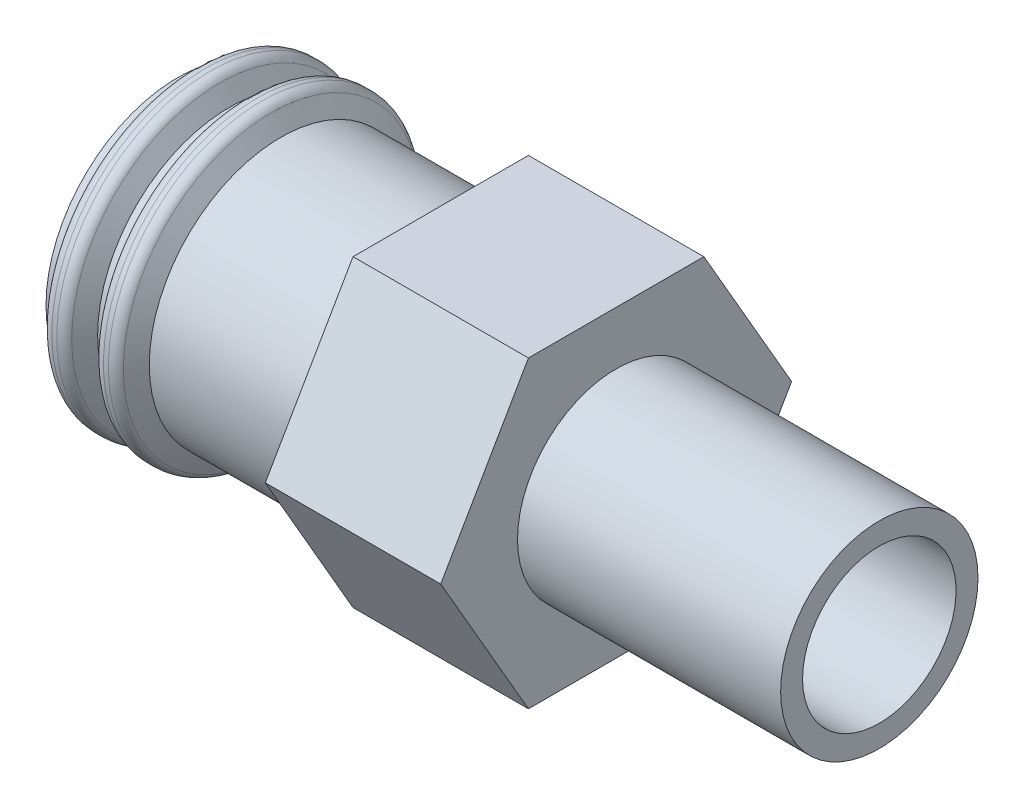
ISO-10303-21;
HEADER;
FILE_DESCRIPTION(('STEP AP214'),'2;1');
FILE_NAME('part.step','',(''),(''),'','','');
FILE_SCHEMA(('AUTOMOTIVE_DESIGN { 1 0 10303 214 1 1 1 1 }'));
ENDSEC;
DATA;
#1=APPLICATION_CONTEXT('core data for automotive mechanical design processes');
#2=APPLICATION_PROTOCOL_DEFINITION('international standard','automotive_design',2000,#1);
#3=PRODUCT_CONTEXT('',#1,'mechanical');
#4=PRODUCT('Part','Part','',(#3));
#5=PRODUCT_RELATED_PRODUCT_CATEGORY('part','',(#4));
#6=PRODUCT_DEFINITION_FORMATION('','',#4);
#7=PRODUCT_DEFINITION_CONTEXT('part definition',#1,'design');
#8=PRODUCT_DEFINITION('design','',#6,#7);
#9=PRODUCT_DEFINITION_SHAPE('','',#8);
#10=(LENGTH_UNIT() NAMED_UNIT(*) SI_UNIT(.MILLI.,.METRE.));
#11=(NAMED_UNIT(*) PLANE_ANGLE_UNIT() SI_UNIT($,.RADIAN.));
#12=(NAMED_UNIT(*) SI_UNIT($,.STERADIAN.) SOLID_ANGLE_UNIT());
#13=UNCERTAINTY_MEASURE_WITH_UNIT(LENGTH_MEASURE(1.E-05),#10,'distance_accuracy_value','');
#14=(GEOMETRIC_REPRESENTATION_CONTEXT(3) GLOBAL_UNCERTAINTY_ASSIGNED_CONTEXT((#13)) GLOBAL_UNIT_ASSIGNED_CONTEXT((#10,
#11,#12)) REPRESENTATION_CONTEXT('',''));
#15=CARTESIAN_POINT('',(0.,0.,0.));
#16=DIRECTION('',(0.,0.,1.));
#17=DIRECTION('',(1.,0.,0.));
#18=AXIS2_PLACEMENT_3D('',#15,#16,#17);
#19=CARTESIAN_POINT('',(1.5,4.,0.));
#20=DIRECTION('',(-1.,0.,0.));
#21=DIRECTION('',(0.,0.,1.));
#22=AXIS2_PLACEMENT_3D('',#19,#20,#21);
#23=PLANE('',#22);
#24=CARTESIAN_POINT('',(1.5,0.,0.));
#25=DIRECTION('',(-1.,0.,0.));
#26=DIRECTION('',(0.,0.,1.));
#27=AXIS2_PLACEMENT_3D('',#24,#25,#26);
#28=CIRCLE('',#27,2.25);
#29=CARTESIAN_POINT('',(1.5,0.,2.25));
#30=VERTEX_POINT('',#29);
#31=EDGE_CURVE('E168',#30,#30,#28,.T.);
#32=ORIENTED_EDGE('',*,*,#31,.T.);
#33=EDGE_LOOP('',(#32));
#34=FACE_BOUND('',#33,.T.);
#35=DIRECTION('',(0.,0.866025403784438,0.500000000000001));
#36=VECTOR('',#35,1.);
#37=CARTESIAN_POINT('',(1.5,1.73205080756888,-3.));
#38=LINE('',#37,#36);
#39=CARTESIAN_POINT('',(1.5,0.,-4.));
#40=VERTEX_POINT('',#39);
#41=CARTESIAN_POINT('',(1.5,3.46410161513776,-1.99999999999999));
#42=VERTEX_POINT('',#41);
#43=EDGE_CURVE('E104',#40,#42,#38,.T.);
#44=ORIENTED_EDGE('',*,*,#43,.T.);
#45=DIRECTION('',(0.,0.,1.));
#46=VECTOR('',#45,1.);
#47=CARTESIAN_POINT('',(1.5,3.46410161513775,0.));
#48=LINE('',#47,#46);
#49=CARTESIAN_POINT('',(1.5,3.46410161513775,2.00000000000002));
#50=VERTEX_POINT('',#49);
#51=EDGE_CURVE('E145',#42,#50,#48,.T.);
#52=ORIENTED_EDGE('',*,*,#51,.T.);
#53=DIRECTION('',(0.,-0.866025403784442,0.499999999999995));
#54=VECTOR('',#53,1.);
#55=CARTESIAN_POINT('',(1.5,1.73205080756886,3.00000000000001));
#56=LINE('',#55,#54);
#57=CARTESIAN_POINT('',(1.5,0.,4.));
#58=VERTEX_POINT('',#57);
#59=EDGE_CURVE('E60',#50,#58,#56,.T.);
#60=ORIENTED_EDGE('',*,*,#59,.T.);
#61=DIRECTION('',(0.,-0.866025403784435,-0.500000000000007));
#62=VECTOR('',#61,1.);
#63=CARTESIAN_POINT('',(1.5,-1.7320508075689,2.99999999999998));
#64=LINE('',#63,#62);
#65=CARTESIAN_POINT('',(1.5,-3.46410161513777,1.99999999999997));
#66=VERTEX_POINT('',#65);
#67=EDGE_CURVE('E69',#58,#66,#64,.T.);
#68=ORIENTED_EDGE('',*,*,#67,.T.);
#69=DIRECTION('',(0.,0.,-1.));
#70=VECTOR('',#69,1.);
#71=CARTESIAN_POINT('',(1.5,-3.46410161513775,0.));
#72=LINE('',#71,#70);
#73=CARTESIAN_POINT('',(1.5,-3.46410161513773,-2.00000000000004));
#74=VERTEX_POINT('',#73);
#75=EDGE_CURVE('E124',#66,#74,#72,.T.);
#76=ORIENTED_EDGE('',*,*,#75,.T.);
#77=DIRECTION('',(0.,0.866025403784442,-0.499999999999995));
#78=VECTOR('',#77,1.);
#79=CARTESIAN_POINT('',(1.5,-1.73205080756887,-3.00000000000002));
#80=LINE('',#79,#78);
#81=EDGE_CURVE('E109',#74,#40,#80,.T.);
#82=ORIENTED_EDGE('',*,*,#81,.T.);
#83=EDGE_LOOP('',(#44,#52,#60,#68,#76,#82));
#84=FACE_BOUND('',#83,.T.);
#85=ADVANCED_FACE('F45',(#34,#84),#23,.F.);
#86=CARTESIAN_POINT('',(-2.5,3.,0.));
#87=DIRECTION('',(1.,0.,0.));
#88=DIRECTION('',(0.,0.,-1.));
#89=AXIS2_PLACEMENT_3D('',#86,#87,#88);
#90=PLANE('',#89);
#91=CARTESIAN_POINT('',(-2.5,0.,0.));
#92=DIRECTION('',(-1.,0.,0.));
#93=DIRECTION('',(0.,0.,1.));
#94=AXIS2_PLACEMENT_3D('',#91,#92,#93);
#95=CIRCLE('',#94,3.);
#96=CARTESIAN_POINT('',(-2.5,0.,3.));
#97=VERTEX_POINT('',#96);
#98=EDGE_CURVE('E165',#97,#97,#95,.T.);
#99=ORIENTED_EDGE('',*,*,#98,.F.);
#100=EDGE_LOOP('',(#99));
#101=FACE_BOUND('',#100,.T.);
#102=DIRECTION('',(0.,0.866025403784438,0.500000000000001));
#103=VECTOR('',#102,1.);
#104=CARTESIAN_POINT('',(-2.5,1.73205080756888,-3.));
#105=LINE('',#104,#103);
#106=CARTESIAN_POINT('',(-2.5,0.,-4.));
#107=VERTEX_POINT('',#106);
#108=CARTESIAN_POINT('',(-2.5,3.46410161513776,-1.99999999999999));
#109=VERTEX_POINT('',#108);
#110=EDGE_CURVE('E101',#107,#109,#105,.T.);
#111=ORIENTED_EDGE('',*,*,#110,.F.);
#112=DIRECTION('',(0.,0.866025403784442,-0.499999999999995));
#113=VECTOR('',#112,1.);
#114=CARTESIAN_POINT('',(-2.5,-1.73205080756887,-3.00000000000002));
#115=LINE('',#114,#113);
#116=CARTESIAN_POINT('',(-2.5,-3.46410161513773,-2.00000000000004));
#117=VERTEX_POINT('',#116);
#118=EDGE_CURVE('E108',#117,#107,#115,.T.);
#119=ORIENTED_EDGE('',*,*,#118,.F.);
#120=DIRECTION('',(0.,0.,-1.));
#121=VECTOR('',#120,1.);
#122=CARTESIAN_POINT('',(-2.5,-3.46410161513775,0.));
#123=LINE('',#122,#121);
#124=CARTESIAN_POINT('',(-2.5,-3.46410161513777,1.99999999999997));
#125=VERTEX_POINT('',#124);
#126=EDGE_CURVE('E130',#125,#117,#123,.T.);
#127=ORIENTED_EDGE('',*,*,#126,.F.);
#128=DIRECTION('',(0.,-0.866025403784435,-0.500000000000007));
#129=VECTOR('',#128,1.);
#130=CARTESIAN_POINT('',(-2.5,-1.7320508075689,2.99999999999998));
#131=LINE('',#130,#129);
#132=CARTESIAN_POINT('',(-2.5,0.,4.));
#133=VERTEX_POINT('',#132);
#134=EDGE_CURVE('E135',#133,#125,#131,.T.);
#135=ORIENTED_EDGE('',*,*,#134,.F.);
#136=DIRECTION('',(0.,-0.866025403784442,0.499999999999995));
#137=VECTOR('',#136,1.);
#138=CARTESIAN_POINT('',(-2.5,1.73205080756886,3.00000000000001));
#139=LINE('',#138,#137);
#140=CARTESIAN_POINT('',(-2.5,3.46410161513775,2.00000000000002));
#141=VERTEX_POINT('',#140);
#142=EDGE_CURVE('E141',#141,#133,#139,.T.);
#143=ORIENTED_EDGE('',*,*,#142,.F.);
#144=DIRECTION('',(0.,0.,1.));
#145=VECTOR('',#144,1.);
#146=CARTESIAN_POINT('',(-2.5,3.46410161513775,0.));
#147=LINE('',#146,#145);
#148=EDGE_CURVE('E119',#109,#141,#147,.T.);
#149=ORIENTED_EDGE('',*,*,#148,.F.);
#150=EDGE_LOOP('',(#111,#119,#127,#135,#143,#149));
#151=FACE_BOUND('',#150,.T.);
#152=ADVANCED_FACE('F114',(#101,#151),#90,.F.);
#153=CARTESIAN_POINT('',(-29.7219053344211,0.,0.));
#154=DIRECTION('',(-1.,0.,0.));
#155=DIRECTION('',(0.,0.,1.));
#156=AXIS2_PLACEMENT_3D('',#153,#154,#155);
#157=CYLINDRICAL_SURFACE('',#156,3.);
#158=CARTESIAN_POINT('',(-8.5,0.,0.));
#159=DIRECTION('',(-1.,0.,0.));
#160=DIRECTION('',(0.,0.,1.));
#161=AXIS2_PLACEMENT_3D('',#158,#159,#160);
#162=CIRCLE('',#161,3.);
#163=CARTESIAN_POINT('',(-8.5,0.,3.));
#164=VERTEX_POINT('',#163);
#165=EDGE_CURVE('E186',#164,#164,#162,.T.);
#166=ORIENTED_EDGE('',*,*,#165,.F.);
#167=EDGE_LOOP('',(#166));
#168=FACE_BOUND('',#167,.T.);
#169=CARTESIAN_POINT('',(-8.3,0.,0.));
#170=DIRECTION('',(-1.,0.,0.));
#171=DIRECTION('',(0.,0.,1.));
#172=AXIS2_PLACEMENT_3D('',#169,#170,#171);
#173=CIRCLE('',#172,3.);
#174=CARTESIAN_POINT('',(-8.3,0.,3.));
#175=VERTEX_POINT('',#174);
#176=EDGE_CURVE('E152',#175,#175,#173,.T.);
#177=ORIENTED_EDGE('',*,*,#176,.T.);
#178=EDGE_LOOP('',(#177));
#179=FACE_BOUND('',#178,.T.);
#180=ADVANCED_FACE('F242',(#168,#179),#157,.T.);
#181=CARTESIAN_POINT('',(-8.5,2.5,0.));
#182=DIRECTION('',(1.,0.,0.));
#183=DIRECTION('',(0.,0.,-1.));
#184=AXIS2_PLACEMENT_3D('',#181,#182,#183);
#185=PLANE('',#184);
#186=CARTESIAN_POINT('',(-8.5,0.,0.));
#187=DIRECTION('',(-1.,0.,0.));
#188=DIRECTION('',(0.,0.,1.));
#189=AXIS2_PLACEMENT_3D('',#186,#187,#188);
#190=CIRCLE('',#189,2.5);
#191=CARTESIAN_POINT('',(-8.5,0.,2.5));
#192=VERTEX_POINT('',#191);
#193=EDGE_CURVE('E183',#192,#192,#190,.T.);
#194=ORIENTED_EDGE('',*,*,#193,.F.);
#195=EDGE_LOOP('',(#194));
#196=FACE_BOUND('',#195,.T.);
#197=ORIENTED_EDGE('',*,*,#165,.T.);
#198=EDGE_LOOP('',(#197));
#199=FACE_BOUND('',#198,.T.);
#200=ADVANCED_FACE('F268',(#196,#199),#185,.F.);
#201=CARTESIAN_POINT('',(-29.7219053344211,0.,0.));
#202=DIRECTION('',(-1.,0.,0.));
#203=DIRECTION('',(0.,0.,1.));
#204=AXIS2_PLACEMENT_3D('',#201,#202,#203);
#205=CYLINDRICAL_SURFACE('',#204,2.5);
#206=CARTESIAN_POINT('',(-4.5,0.,0.));
#207=DIRECTION('',(-1.,0.,0.));
#208=DIRECTION('',(0.,0.,1.));
#209=AXIS2_PLACEMENT_3D('',#206,#207,#208);
#210=CIRCLE('',#209,2.5);
#211=CARTESIAN_POINT('',(-4.5,0.,2.5));
#212=VERTEX_POINT('',#211);
#213=EDGE_CURVE('E180',#212,#212,#210,.T.);
#214=ORIENTED_EDGE('',*,*,#213,.F.);
#215=EDGE_LOOP('',(#214));
#216=FACE_BOUND('',#215,.T.);
#217=ORIENTED_EDGE('',*,*,#193,.T.);
#218=EDGE_LOOP('',(#217));
#219=FACE_BOUND('',#218,.T.);
#220=ADVANCED_FACE('F264',(#216,#219),#205,.F.);
#221=CARTESIAN_POINT('',(-4.5,0.,0.));
#222=DIRECTION('',(-1.,0.,0.));
#223=DIRECTION('',(0.,0.,1.));
#224=AXIS2_PLACEMENT_3D('',#221,#222,#223);
#225=CONICAL_SURFACE('',#224,2.5,0.523598775598292);
#226=CARTESIAN_POINT('',(-3.20096189432332,0.,0.));
#227=DIRECTION('',(-1.,0.,0.));
#228=DIRECTION('',(0.,0.,1.));
#229=AXIS2_PLACEMENT_3D('',#226,#227,#228);
#230=CIRCLE('',#229,1.75);
#231=CARTESIAN_POINT('',(-3.20096189432332,0.,1.75));
#232=VERTEX_POINT('',#231);
#233=EDGE_CURVE('E177',#232,#232,#230,.T.);
#234=ORIENTED_EDGE('',*,*,#233,.F.);
#235=EDGE_LOOP('',(#234));
#236=FACE_BOUND('',#235,.T.);
#237=ORIENTED_EDGE('',*,*,#213,.T.);
#238=EDGE_LOOP('',(#237));
#239=FACE_BOUND('',#238,.T.);
#240=ADVANCED_FACE('F260',(#236,#239),#225,.F.);
#241=CARTESIAN_POINT('',(-29.7219053344211,0.,0.));
#242=DIRECTION('',(-1.,0.,0.));
#243=DIRECTION('',(0.,0.,1.));
#244=AXIS2_PLACEMENT_3D('',#241,#242,#243);
#245=CYLINDRICAL_SURFACE('',#244,1.75);
#246=CARTESIAN_POINT('',(7.5,0.,0.));
#247=DIRECTION('',(-1.,0.,0.));
#248=DIRECTION('',(0.,0.,1.));
#249=AXIS2_PLACEMENT_3D('',#246,#247,#248);
#250=CIRCLE('',#249,1.75);
#251=CARTESIAN_POINT('',(7.5,0.,1.75));
#252=VERTEX_POINT('',#251);
#253=EDGE_CURVE('E174',#252,#252,#250,.T.);
#254=ORIENTED_EDGE('',*,*,#253,.F.);
#255=EDGE_LOOP('',(#254));
#256=FACE_BOUND('',#255,.T.);
#257=ORIENTED_EDGE('',*,*,#233,.T.);
#258=EDGE_LOOP('',(#257));
#259=FACE_BOUND('',#258,.T.);
#260=ADVANCED_FACE('F256',(#256,#259),#245,.F.);
#261=CARTESIAN_POINT('',(7.5,2.25,0.));
#262=DIRECTION('',(-1.,0.,0.));
#263=DIRECTION('',(0.,0.,1.));
#264=AXIS2_PLACEMENT_3D('',#261,#262,#263);
#265=PLANE('',#264);
#266=CARTESIAN_POINT('',(7.5,0.,0.));
#267=DIRECTION('',(-1.,0.,0.));
#268=DIRECTION('',(0.,0.,1.));
#269=AXIS2_PLACEMENT_3D('',#266,#267,#268);
#270=CIRCLE('',#269,2.25);
#271=CARTESIAN_POINT('',(7.5,0.,2.25));
#272=VERTEX_POINT('',#271);
#273=EDGE_CURVE('E171',#272,#272,#270,.T.);
#274=ORIENTED_EDGE('',*,*,#273,.F.);
#275=EDGE_LOOP('',(#274));
#276=FACE_BOUND('',#275,.T.);
#277=ORIENTED_EDGE('',*,*,#253,.T.);
#278=EDGE_LOOP('',(#277));
#279=FACE_BOUND('',#278,.T.);
#280=ADVANCED_FACE('F252',(#276,#279),#265,.F.);
#281=CARTESIAN_POINT('',(-29.7219053344211,0.,0.));
#282=DIRECTION('',(-1.,0.,0.));
#283=DIRECTION('',(0.,0.,1.));
#284=AXIS2_PLACEMENT_3D('',#281,#282,#283);
#285=CYLINDRICAL_SURFACE('',#284,2.25);
#286=ORIENTED_EDGE('',*,*,#31,.F.);
#287=EDGE_LOOP('',(#286));
#288=FACE_BOUND('',#287,.T.);
#289=ORIENTED_EDGE('',*,*,#273,.T.);
#290=EDGE_LOOP('',(#289));
#291=FACE_BOUND('',#290,.T.);
#292=ADVANCED_FACE('F248',(#288,#291),#285,.T.);
#293=CARTESIAN_POINT('',(-29.7219053344211,0.,0.));
#294=DIRECTION('',(-1.,0.,0.));
#295=DIRECTION('',(0.,0.,1.));
#296=AXIS2_PLACEMENT_3D('',#293,#294,#295);
#297=CYLINDRICAL_SURFACE('',#296,3.);
#298=CARTESIAN_POINT('',(-6.14529946162075,0.,0.));
#299=DIRECTION('',(-1.,0.,0.));
#300=DIRECTION('',(0.,0.,1.));
#301=AXIS2_PLACEMENT_3D('',#298,#299,#300);
#302=CIRCLE('',#301,3.);
#303=CARTESIAN_POINT('',(-6.14529946162075,0.,3.));
#304=VERTEX_POINT('',#303);
#305=EDGE_CURVE('E162',#304,#304,#302,.T.);
#306=ORIENTED_EDGE('',*,*,#305,.F.);
#307=EDGE_LOOP('',(#306));
#308=FACE_BOUND('',#307,.T.);
#309=ORIENTED_EDGE('',*,*,#98,.T.);
#310=EDGE_LOOP('',(#309));
#311=FACE_BOUND('',#310,.T.);
#312=ADVANCED_FACE('F251',(#308,#311),#297,.T.);
#313=CARTESIAN_POINT('',(-6.14529946162075,0.,0.));
#314=DIRECTION('',(-1.,0.,0.));
#315=DIRECTION('',(0.,0.,1.));
#316=AXIS2_PLACEMENT_3D('',#313,#314,#315);
#317=CONICAL_SURFACE('',#316,3.,1.0471975511966);
#318=CARTESIAN_POINT('',(-6.36180581256686,0.,0.));
#319=DIRECTION('',(1.,0.,0.));
#320=DIRECTION('',(0.,0.,-1.));
#321=AXIS2_PLACEMENT_3D('',#318,#319,#320);
#322=CIRCLE('',#321,3.375);
#323=CARTESIAN_POINT('',(-6.36180581256686,0.,-3.375));
#324=VERTEX_POINT('',#323);
#325=EDGE_CURVE('E12',#324,#324,#322,.T.);
#326=ORIENTED_EDGE('',*,*,#325,.T.);
#327=EDGE_LOOP('',(#326));
#328=FACE_BOUND('',#327,.T.);
#329=ORIENTED_EDGE('',*,*,#305,.T.);
#330=EDGE_LOOP('',(#329));
#331=FACE_BOUND('',#330,.T.);
#332=ADVANCED_FACE('F339',(#328,#331),#317,.T.);
#333=CARTESIAN_POINT('',(-29.7219053344211,0.,0.));
#334=DIRECTION('',(-1.,0.,0.));
#335=DIRECTION('',(0.,0.,1.));
#336=AXIS2_PLACEMENT_3D('',#333,#334,#335);
#337=CYLINDRICAL_SURFACE('',#336,3.5);
#338=CARTESIAN_POINT('',(-6.68963702891815,0.,0.));
#339=DIRECTION('',(1.,0.,0.));
#340=DIRECTION('',(0.,0.,-1.));
#341=AXIS2_PLACEMENT_3D('',#338,#339,#340);
#342=CIRCLE('',#341,3.5);
#343=CARTESIAN_POINT('',(-6.68963702891815,0.,-3.5));
#344=VERTEX_POINT('',#343);
#345=EDGE_CURVE('E53',#344,#344,#342,.T.);
#346=ORIENTED_EDGE('',*,*,#345,.T.);
#347=EDGE_LOOP('',(#346));
#348=FACE_BOUND('',#347,.T.);
#349=CARTESIAN_POINT('',(-6.57831216351297,0.,0.));
#350=DIRECTION('',(1.,0.,0.));
#351=DIRECTION('',(0.,0.,-1.));
#352=AXIS2_PLACEMENT_3D('',#349,#350,#351);
#353=CIRCLE('',#352,3.5);
#354=CARTESIAN_POINT('',(-6.57831216351297,0.,-3.5));
#355=VERTEX_POINT('',#354);
#356=EDGE_CURVE('E204',#355,#355,#353,.F.);
#357=ORIENTED_EDGE('',*,*,#356,.T.);
#358=EDGE_LOOP('',(#357));
#359=FACE_BOUND('',#358,.T.);
#360=ADVANCED_FACE('F209',(#348,#359),#337,.T.);
#361=CARTESIAN_POINT('',(-6.83397459621556,0.,0.));
#362=DIRECTION('',(1.,0.,0.));
#363=DIRECTION('',(0.,0.,-1.));
#364=AXIS2_PLACEMENT_3D('',#361,#362,#363);
#365=CONICAL_SURFACE('',#364,3.5,1.0471975511966);
#366=CARTESIAN_POINT('',(-6.90614337986427,0.,0.));
#367=DIRECTION('',(-1.,0.,0.));
#368=DIRECTION('',(0.,0.,1.));
#369=AXIS2_PLACEMENT_3D('',#366,#367,#368);
#370=CIRCLE('',#369,3.375);
#371=CARTESIAN_POINT('',(-6.90614337986427,0.,3.375));
#372=VERTEX_POINT('',#371);
#373=EDGE_CURVE('E201',#372,#372,#370,.T.);
#374=ORIENTED_EDGE('',*,*,#373,.T.);
#375=EDGE_LOOP('',(#374));
#376=FACE_BOUND('',#375,.T.);
#377=CARTESIAN_POINT('',(-7.12264973081037,0.,0.));
#378=DIRECTION('',(-1.,0.,0.));
#379=DIRECTION('',(0.,0.,1.));
#380=AXIS2_PLACEMENT_3D('',#377,#378,#379);
#381=CIRCLE('',#380,3.);
#382=CARTESIAN_POINT('',(-7.12264973081037,0.,3.));
#383=VERTEX_POINT('',#382);
#384=EDGE_CURVE('E159',#383,#383,#381,.T.);
#385=ORIENTED_EDGE('',*,*,#384,.F.);
#386=EDGE_LOOP('',(#385));
#387=FACE_BOUND('',#386,.T.);
#388=ADVANCED_FACE('F218',(#376,#387),#365,.T.);
#389=CARTESIAN_POINT('',(-29.7219053344211,0.,0.));
#390=DIRECTION('',(-1.,0.,0.));
#391=DIRECTION('',(0.,0.,1.));
#392=AXIS2_PLACEMENT_3D('',#389,#390,#391);
#393=CYLINDRICAL_SURFACE('',#392,3.);
#394=CARTESIAN_POINT('',(-7.32264973081037,0.,0.));
#395=DIRECTION('',(-1.,0.,0.));
#396=DIRECTION('',(0.,0.,1.));
#397=AXIS2_PLACEMENT_3D('',#394,#395,#396);
#398=CIRCLE('',#397,3.);
#399=CARTESIAN_POINT('',(-7.32264973081037,0.,3.));
#400=VERTEX_POINT('',#399);
#401=EDGE_CURVE('E156',#400,#400,#398,.T.);
#402=ORIENTED_EDGE('',*,*,#401,.F.);
#403=EDGE_LOOP('',(#402));
#404=FACE_BOUND('',#403,.T.);
#405=ORIENTED_EDGE('',*,*,#384,.T.);
#406=EDGE_LOOP('',(#405));
#407=FACE_BOUND('',#406,.T.);
#408=ADVANCED_FACE('F221',(#404,#407),#393,.T.);
#409=CARTESIAN_POINT('',(-7.32264973081037,0.,0.));
#410=DIRECTION('',(-1.,0.,0.));
#411=DIRECTION('',(0.,0.,1.));
#412=AXIS2_PLACEMENT_3D('',#409,#410,#411);
#413=CONICAL_SURFACE('',#412,3.,1.0471975511966);
#414=CARTESIAN_POINT('',(-7.53915608175648,0.,0.));
#415=DIRECTION('',(1.,0.,0.));
#416=DIRECTION('',(0.,0.,-1.));
#417=AXIS2_PLACEMENT_3D('',#414,#415,#416);
#418=CIRCLE('',#417,3.375);
#419=CARTESIAN_POINT('',(-7.53915608175648,0.,-3.375));
#420=VERTEX_POINT('',#419);
#421=EDGE_CURVE('E195',#420,#420,#418,.T.);
#422=ORIENTED_EDGE('',*,*,#421,.T.);
#423=EDGE_LOOP('',(#422));
#424=FACE_BOUND('',#423,.T.);
#425=ORIENTED_EDGE('',*,*,#401,.T.);
#426=EDGE_LOOP('',(#425));
#427=FACE_BOUND('',#426,.T.);
#428=ADVANCED_FACE('F226',(#424,#427),#413,.T.);
#429=CARTESIAN_POINT('',(-29.7219053344211,0.,0.));
#430=DIRECTION('',(-1.,0.,0.));
#431=DIRECTION('',(0.,0.,1.));
#432=AXIS2_PLACEMENT_3D('',#429,#430,#431);
#433=CYLINDRICAL_SURFACE('',#432,3.5);
#434=CARTESIAN_POINT('',(-7.75566243270259,0.,0.));
#435=DIRECTION('',(1.,0.,0.));
#436=DIRECTION('',(0.,0.,-1.));
#437=AXIS2_PLACEMENT_3D('',#434,#435,#436);
#438=CIRCLE('',#437,3.5);
#439=CARTESIAN_POINT('',(-7.75566243270259,0.,-3.5));
#440=VERTEX_POINT('',#439);
#441=EDGE_CURVE('E192',#440,#440,#438,.F.);
#442=ORIENTED_EDGE('',*,*,#441,.T.);
#443=EDGE_LOOP('',(#442));
#444=FACE_BOUND('',#443,.T.);
#445=CARTESIAN_POINT('',(-7.86698729810778,0.,0.));
#446=DIRECTION('',(1.,0.,0.));
#447=DIRECTION('',(0.,0.,-1.));
#448=AXIS2_PLACEMENT_3D('',#445,#446,#447);
#449=CIRCLE('',#448,3.5);
#450=CARTESIAN_POINT('',(-7.86698729810778,0.,-3.5));
#451=VERTEX_POINT('',#450);
#452=EDGE_CURVE('E189',#451,#451,#449,.T.);
#453=ORIENTED_EDGE('',*,*,#452,.T.);
#454=EDGE_LOOP('',(#453));
#455=FACE_BOUND('',#454,.T.);
#456=ADVANCED_FACE('F232',(#444,#455),#433,.T.);
#457=CARTESIAN_POINT('',(-8.01132486540518,0.,0.));
#458=DIRECTION('',(1.,0.,0.));
#459=DIRECTION('',(0.,0.,-1.));
#460=AXIS2_PLACEMENT_3D('',#457,#458,#459);
#461=CONICAL_SURFACE('',#460,3.5,1.04719755119659);
#462=CARTESIAN_POINT('',(-8.08349364905389,0.,0.));
#463=DIRECTION('',(-1.,0.,0.));
#464=DIRECTION('',(0.,0.,1.));
#465=AXIS2_PLACEMENT_3D('',#462,#463,#464);
#466=CIRCLE('',#465,3.375);
#467=CARTESIAN_POINT('',(-8.08349364905389,0.,3.375));
#468=VERTEX_POINT('',#467);
#469=EDGE_CURVE('E198',#468,#468,#466,.T.);
#470=ORIENTED_EDGE('',*,*,#469,.T.);
#471=EDGE_LOOP('',(#470));
#472=FACE_BOUND('',#471,.T.);
#473=ORIENTED_EDGE('',*,*,#176,.F.);
#474=EDGE_LOOP('',(#473));
#475=FACE_BOUND('',#474,.T.);
#476=ADVANCED_FACE('F288',(#472,#475),#461,.T.);
#477=CARTESIAN_POINT('',(-2.5,3.46410161513775,0.));
#478=DIRECTION('',(0.,1.,0.));
#479=DIRECTION('',(0.,0.,1.));
#480=AXIS2_PLACEMENT_3D('',#477,#478,#479);
#481=PLANE('',#480);
#482=ORIENTED_EDGE('',*,*,#51,.F.);
#483=DIRECTION('',(1.,0.,0.));
#484=VECTOR('',#483,1.);
#485=CARTESIAN_POINT('',(-2.5,3.46410161513776,-1.99999999999999));
#486=LINE('',#485,#484);
#487=EDGE_CURVE('E147',#109,#42,#486,.T.);
#488=ORIENTED_EDGE('',*,*,#487,.F.);
#489=ORIENTED_EDGE('',*,*,#148,.T.);
#490=DIRECTION('',(1.,0.,0.));
#491=VECTOR('',#490,1.);
#492=CARTESIAN_POINT('',(-2.5,3.46410161513775,2.00000000000002));
#493=LINE('',#492,#491);
#494=EDGE_CURVE('E150',#141,#50,#493,.T.);
#495=ORIENTED_EDGE('',*,*,#494,.T.);
#496=EDGE_LOOP('',(#482,#488,#489,#495));
#497=FACE_BOUND('',#496,.T.);
#498=ADVANCED_FACE('F291',(#497),#481,.T.);
#499=CARTESIAN_POINT('',(-2.5,1.73205080756886,3.00000000000001));
#500=DIRECTION('',(0.,0.499999999999995,0.866025403784442));
#501=DIRECTION('',(0.,-0.866025403784442,0.499999999999995));
#502=AXIS2_PLACEMENT_3D('',#499,#500,#501);
#503=PLANE('',#502);
#504=ORIENTED_EDGE('',*,*,#59,.F.);
#505=ORIENTED_EDGE('',*,*,#494,.F.);
#506=ORIENTED_EDGE('',*,*,#142,.T.);
#507=DIRECTION('',(1.,0.,0.));
#508=VECTOR('',#507,1.);
#509=CARTESIAN_POINT('',(-2.5,0.,4.));
#510=LINE('',#509,#508);
#511=EDGE_CURVE('E139',#133,#58,#510,.T.);
#512=ORIENTED_EDGE('',*,*,#511,.T.);
#513=EDGE_LOOP('',(#504,#505,#506,#512));
#514=FACE_BOUND('',#513,.T.);
#515=ADVANCED_FACE('F299',(#514),#503,.T.);
#516=CARTESIAN_POINT('',(-2.5,-1.7320508075689,2.99999999999998));
#517=DIRECTION('',(0.,-0.500000000000007,0.866025403784435));
#518=DIRECTION('',(0.,-0.866025403784435,-0.500000000000007));
#519=AXIS2_PLACEMENT_3D('',#516,#517,#518);
#520=PLANE('',#519);
#521=ORIENTED_EDGE('',*,*,#67,.F.);
#522=ORIENTED_EDGE('',*,*,#511,.F.);
#523=ORIENTED_EDGE('',*,*,#134,.T.);
#524=DIRECTION('',(1.,0.,0.));
#525=VECTOR('',#524,1.);
#526=CARTESIAN_POINT('',(-2.5,-3.46410161513777,1.99999999999997));
#527=LINE('',#526,#525);
#528=EDGE_CURVE('E133',#125,#66,#527,.T.);
#529=ORIENTED_EDGE('',*,*,#528,.T.);
#530=EDGE_LOOP('',(#521,#522,#523,#529));
#531=FACE_BOUND('',#530,.T.);
#532=ADVANCED_FACE('F307',(#531),#520,.T.);
#533=CARTESIAN_POINT('',(-2.5,-3.46410161513775,0.));
#534=DIRECTION('',(0.,-1.,0.));
#535=DIRECTION('',(0.,0.,-1.));
#536=AXIS2_PLACEMENT_3D('',#533,#534,#535);
#537=PLANE('',#536);
#538=ORIENTED_EDGE('',*,*,#75,.F.);
#539=ORIENTED_EDGE('',*,*,#528,.F.);
#540=ORIENTED_EDGE('',*,*,#126,.T.);
#541=DIRECTION('',(1.,0.,0.));
#542=VECTOR('',#541,1.);
#543=CARTESIAN_POINT('',(-2.5,-3.46410161513773,-2.00000000000004));
#544=LINE('',#543,#542);
#545=EDGE_CURVE('E123',#117,#74,#544,.T.);
#546=ORIENTED_EDGE('',*,*,#545,.T.);
#547=EDGE_LOOP('',(#538,#539,#540,#546));
#548=FACE_BOUND('',#547,.T.);
#549=ADVANCED_FACE('F310',(#548),#537,.T.);
#550=CARTESIAN_POINT('',(-2.5,-1.73205080756887,-3.00000000000002));
#551=DIRECTION('',(0.,-0.499999999999995,-0.866025403784442));
#552=DIRECTION('',(0.,0.866025403784442,-0.499999999999995));
#553=AXIS2_PLACEMENT_3D('',#550,#551,#552);
#554=PLANE('',#553);
#555=ORIENTED_EDGE('',*,*,#81,.F.);
#556=ORIENTED_EDGE('',*,*,#545,.F.);
#557=ORIENTED_EDGE('',*,*,#118,.T.);
#558=DIRECTION('',(1.,0.,0.));
#559=VECTOR('',#558,1.);
#560=CARTESIAN_POINT('',(-2.5,0.,-4.));
#561=LINE('',#560,#559);
#562=EDGE_CURVE('E98',#107,#40,#561,.T.);
#563=ORIENTED_EDGE('',*,*,#562,.T.);
#564=EDGE_LOOP('',(#555,#556,#557,#563));
#565=FACE_BOUND('',#564,.T.);
#566=ADVANCED_FACE('F121',(#565),#554,.T.);
#567=CARTESIAN_POINT('',(-2.5,1.73205080756888,-3.));
#568=DIRECTION('',(0.,0.500000000000001,-0.866025403784438));
#569=DIRECTION('',(0.,0.866025403784438,0.500000000000001));
#570=AXIS2_PLACEMENT_3D('',#567,#568,#569);
#571=PLANE('',#570);
#572=ORIENTED_EDGE('',*,*,#43,.F.);
#573=ORIENTED_EDGE('',*,*,#562,.F.);
#574=ORIENTED_EDGE('',*,*,#110,.T.);
#575=ORIENTED_EDGE('',*,*,#487,.T.);
#576=EDGE_LOOP('',(#572,#573,#574,#575));
#577=FACE_BOUND('',#576,.T.);
#578=ADVANCED_FACE('F100',(#577),#571,.T.);
#579=CARTESIAN_POINT('',(-7.75566243270259,0.,0.));
#580=DIRECTION('',(1.,0.,0.));
#581=DIRECTION('',(0.,0.,-1.));
#582=AXIS2_PLACEMENT_3D('',#579,#580,#581);
#583=TOROIDAL_SURFACE('',#582,3.25,0.25);
#584=ORIENTED_EDGE('',*,*,#421,.F.);
#585=EDGE_LOOP('',(#584));
#586=FACE_BOUND('',#585,.T.);
#587=ORIENTED_EDGE('',*,*,#441,.F.);
#588=EDGE_LOOP('',(#587));
#589=FACE_BOUND('',#588,.T.);
#590=ADVANCED_FACE('F276',(#586,#589),#583,.T.);
#591=CARTESIAN_POINT('',(-7.86698729810778,0.,0.));
#592=DIRECTION('',(1.,0.,0.));
#593=DIRECTION('',(0.,0.,-1.));
#594=AXIS2_PLACEMENT_3D('',#591,#592,#593);
#595=TOROIDAL_SURFACE('',#594,3.25,0.25);
#596=ORIENTED_EDGE('',*,*,#452,.F.);
#597=EDGE_LOOP('',(#596));
#598=FACE_BOUND('',#597,.T.);
#599=ORIENTED_EDGE('',*,*,#469,.F.);
#600=EDGE_LOOP('',(#599));
#601=FACE_BOUND('',#600,.T.);
#602=ADVANCED_FACE('F215',(#598,#601),#595,.T.);
#603=CARTESIAN_POINT('',(-6.68963702891815,0.,0.));
#604=DIRECTION('',(1.,0.,0.));
#605=DIRECTION('',(0.,0.,-1.));
#606=AXIS2_PLACEMENT_3D('',#603,#604,#605);
#607=TOROIDAL_SURFACE('',#606,3.25,0.25);
#608=ORIENTED_EDGE('',*,*,#345,.F.);
#609=EDGE_LOOP('',(#608));
#610=FACE_BOUND('',#609,.T.);
#611=ORIENTED_EDGE('',*,*,#373,.F.);
#612=EDGE_LOOP('',(#611));
#613=FACE_BOUND('',#612,.T.);
#614=ADVANCED_FACE('F212',(#610,#613),#607,.T.);
#615=CARTESIAN_POINT('',(-6.57831216351297,0.,0.));
#616=DIRECTION('',(1.,0.,0.));
#617=DIRECTION('',(0.,0.,-1.));
#618=AXIS2_PLACEMENT_3D('',#615,#616,#617);
#619=TOROIDAL_SURFACE('',#618,3.25,0.25);
#620=ORIENTED_EDGE('',*,*,#325,.F.);
#621=EDGE_LOOP('',(#620));
#622=FACE_BOUND('',#621,.T.);
#623=ORIENTED_EDGE('',*,*,#356,.F.);
#624=EDGE_LOOP('',(#623));
#625=FACE_BOUND('',#624,.T.);
#626=ADVANCED_FACE('F47',(#622,#625),#619,.T.);
#627=CLOSED_SHELL('',(#85,#152,#180,#200,#220,#240,#260,#280,#292,#312,#332,#360,#388,#408,#428,
#456,#476,#498,#515,#532,#549,#566,#578,#590,#602,#614,#626));
#628=MANIFOLD_SOLID_BREP('B2',#627);
#629=ADVANCED_BREP_SHAPE_REPRESENTATION('',(#18,#628),#14);
#630=SHAPE_DEFINITION_REPRESENTATION(#9,#629);
ENDSEC;
END-ISO-10303-21;
